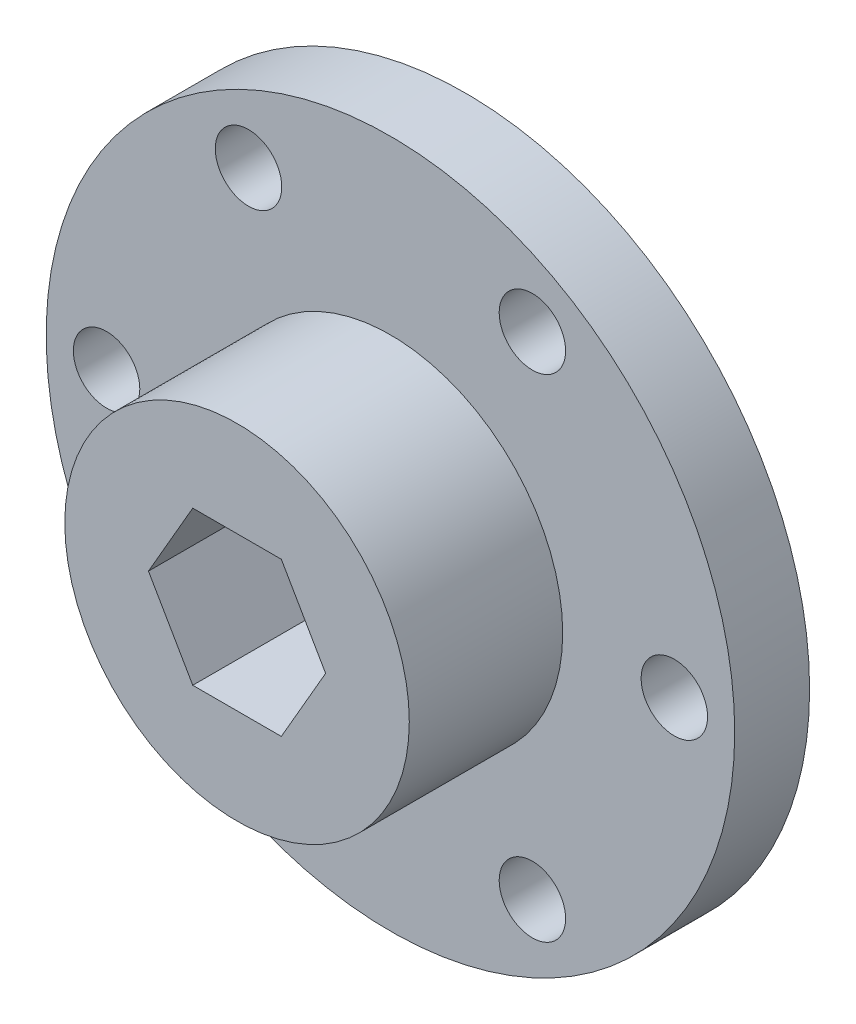
ISO-10303-21;
HEADER;
FILE_DESCRIPTION(('STEP AP214'),'2;1');
FILE_NAME('part.step','',(''),(''),'','','');
FILE_SCHEMA(('AUTOMOTIVE_DESIGN { 1 0 10303 214 1 1 1 1 }'));
ENDSEC;
DATA;
#1=APPLICATION_CONTEXT('core data for automotive mechanical design processes');
#2=APPLICATION_PROTOCOL_DEFINITION('international standard','automotive_design',2000,#1);
#3=PRODUCT_CONTEXT('',#1,'mechanical');
#4=PRODUCT('Part','Part','',(#3));
#5=PRODUCT_RELATED_PRODUCT_CATEGORY('part','',(#4));
#6=PRODUCT_DEFINITION_FORMATION('','',#4);
#7=PRODUCT_DEFINITION_CONTEXT('part definition',#1,'design');
#8=PRODUCT_DEFINITION('design','',#6,#7);
#9=PRODUCT_DEFINITION_SHAPE('','',#8);
#10=(LENGTH_UNIT() NAMED_UNIT(*) SI_UNIT(.MILLI.,.METRE.));
#11=(NAMED_UNIT(*) PLANE_ANGLE_UNIT() SI_UNIT($,.RADIAN.));
#12=(NAMED_UNIT(*) SI_UNIT($,.STERADIAN.) SOLID_ANGLE_UNIT());
#13=UNCERTAINTY_MEASURE_WITH_UNIT(LENGTH_MEASURE(1.E-05),#10,'distance_accuracy_value','');
#14=(GEOMETRIC_REPRESENTATION_CONTEXT(3) GLOBAL_UNCERTAINTY_ASSIGNED_CONTEXT((#13)) GLOBAL_UNIT_ASSIGNED_CONTEXT((#10,
#11,#12)) REPRESENTATION_CONTEXT('',''));
#15=CARTESIAN_POINT('',(0.,0.,0.));
#16=DIRECTION('',(0.,0.,1.));
#17=DIRECTION('',(1.,0.,0.));
#18=AXIS2_PLACEMENT_3D('',#15,#16,#17);
#19=CARTESIAN_POINT('',(0.,0.,6.2));
#20=DIRECTION('',(0.,0.,1.));
#21=DIRECTION('',(1.,0.,0.));
#22=AXIS2_PLACEMENT_3D('',#19,#20,#21);
#23=PLANE('',#22);
#24=CARTESIAN_POINT('',(23.5,0.,6.2));
#25=DIRECTION('',(0.,0.,1.));
#26=DIRECTION('',(1.,0.,0.));
#27=AXIS2_PLACEMENT_3D('',#24,#25,#26);
#28=CIRCLE('',#27,2.75);
#29=CARTESIAN_POINT('',(26.25,0.,6.2));
#30=VERTEX_POINT('',#29);
#31=EDGE_CURVE('E108',#30,#30,#28,.T.);
#32=ORIENTED_EDGE('',*,*,#31,.F.);
#33=EDGE_LOOP('',(#32));
#34=FACE_BOUND('',#33,.T.);
#35=CARTESIAN_POINT('',(11.75,-20.3515969889343,6.2));
#36=DIRECTION('',(0.,0.,1.));
#37=DIRECTION('',(1.,0.,0.));
#38=AXIS2_PLACEMENT_3D('',#35,#36,#37);
#39=CIRCLE('',#38,2.75);
#40=CARTESIAN_POINT('',(14.5,-20.3515969889343,6.2));
#41=VERTEX_POINT('',#40);
#42=EDGE_CURVE('E195',#41,#41,#39,.T.);
#43=ORIENTED_EDGE('',*,*,#42,.F.);
#44=EDGE_LOOP('',(#43));
#45=FACE_BOUND('',#44,.T.);
#46=CARTESIAN_POINT('',(-11.75,-20.3515969889343,6.2));
#47=DIRECTION('',(0.,0.,1.));
#48=DIRECTION('',(1.,0.,0.));
#49=AXIS2_PLACEMENT_3D('',#46,#47,#48);
#50=CIRCLE('',#49,2.75);
#51=CARTESIAN_POINT('',(-9.00000000000001,-20.3515969889343,6.2));
#52=VERTEX_POINT('',#51);
#53=EDGE_CURVE('E197',#52,#52,#50,.T.);
#54=ORIENTED_EDGE('',*,*,#53,.F.);
#55=EDGE_LOOP('',(#54));
#56=FACE_BOUND('',#55,.T.);
#57=CARTESIAN_POINT('',(-23.5,0.,6.2));
#58=DIRECTION('',(0.,0.,1.));
#59=DIRECTION('',(1.,0.,0.));
#60=AXIS2_PLACEMENT_3D('',#57,#58,#59);
#61=CIRCLE('',#60,2.75);
#62=CARTESIAN_POINT('',(-20.75,0.,6.2));
#63=VERTEX_POINT('',#62);
#64=EDGE_CURVE('E203',#63,#63,#61,.T.);
#65=ORIENTED_EDGE('',*,*,#64,.F.);
#66=EDGE_LOOP('',(#65));
#67=FACE_BOUND('',#66,.T.);
#68=CARTESIAN_POINT('',(-11.75,20.3515969889343,6.2));
#69=DIRECTION('',(0.,0.,1.));
#70=DIRECTION('',(1.,0.,0.));
#71=AXIS2_PLACEMENT_3D('',#68,#69,#70);
#72=CIRCLE('',#71,2.75);
#73=CARTESIAN_POINT('',(-9.00000000000001,20.3515969889343,6.2));
#74=VERTEX_POINT('',#73);
#75=EDGE_CURVE('E202',#74,#74,#72,.T.);
#76=ORIENTED_EDGE('',*,*,#75,.F.);
#77=EDGE_LOOP('',(#76));
#78=FACE_BOUND('',#77,.T.);
#79=CARTESIAN_POINT('',(11.75,20.3515969889343,6.2));
#80=DIRECTION('',(0.,0.,1.));
#81=DIRECTION('',(1.,0.,0.));
#82=AXIS2_PLACEMENT_3D('',#79,#80,#81);
#83=CIRCLE('',#82,2.75);
#84=CARTESIAN_POINT('',(14.5,20.3515969889343,6.2));
#85=VERTEX_POINT('',#84);
#86=EDGE_CURVE('E207',#85,#85,#83,.T.);
#87=ORIENTED_EDGE('',*,*,#86,.F.);
#88=EDGE_LOOP('',(#87));
#89=FACE_BOUND('',#88,.T.);
#90=CARTESIAN_POINT('',(0.,0.,6.2));
#91=DIRECTION('',(0.,0.,1.));
#92=DIRECTION('',(1.,0.,0.));
#93=AXIS2_PLACEMENT_3D('',#90,#91,#92);
#94=CIRCLE('',#93,14.26);
#95=CARTESIAN_POINT('',(14.26,0.,6.2));
#96=VERTEX_POINT('',#95);
#97=EDGE_CURVE('E11',#96,#96,#94,.T.);
#98=ORIENTED_EDGE('',*,*,#97,.F.);
#99=EDGE_LOOP('',(#98));
#100=FACE_BOUND('',#99,.T.);
#101=CARTESIAN_POINT('',(0.,0.,6.2));
#102=DIRECTION('',(0.,0.,1.));
#103=DIRECTION('',(1.,0.,0.));
#104=AXIS2_PLACEMENT_3D('',#101,#102,#103);
#105=CIRCLE('',#104,28.5);
#106=CARTESIAN_POINT('',(28.5,0.,6.2));
#107=VERTEX_POINT('',#106);
#108=EDGE_CURVE('E48',#107,#107,#105,.T.);
#109=ORIENTED_EDGE('',*,*,#108,.T.);
#110=EDGE_LOOP('',(#109));
#111=FACE_BOUND('',#110,.T.);
#112=ADVANCED_FACE('F39',(#34,#45,#56,#67,#78,#89,#100,#111),#23,.T.);
#113=CARTESIAN_POINT('',(0.,0.,0.));
#114=DIRECTION('',(0.,0.,1.));
#115=DIRECTION('',(1.,0.,0.));
#116=AXIS2_PLACEMENT_3D('',#113,#114,#115);
#117=PLANE('',#116);
#118=CARTESIAN_POINT('',(23.5,0.,0.));
#119=DIRECTION('',(0.,0.,-1.));
#120=DIRECTION('',(-1.,0.,0.));
#121=AXIS2_PLACEMENT_3D('',#118,#119,#120);
#122=CIRCLE('',#121,2.75);
#123=CARTESIAN_POINT('',(20.75,0.,0.));
#124=VERTEX_POINT('',#123);
#125=EDGE_CURVE('E318',#124,#124,#122,.T.);
#126=ORIENTED_EDGE('',*,*,#125,.F.);
#127=EDGE_LOOP('',(#126));
#128=FACE_BOUND('',#127,.T.);
#129=CARTESIAN_POINT('',(11.75,-20.3515969889343,0.));
#130=DIRECTION('',(0.,0.,-1.));
#131=DIRECTION('',(-1.,0.,0.));
#132=AXIS2_PLACEMENT_3D('',#129,#130,#131);
#133=CIRCLE('',#132,2.75);
#134=CARTESIAN_POINT('',(9.,-20.3515969889343,0.));
#135=VERTEX_POINT('',#134);
#136=EDGE_CURVE('E317',#135,#135,#133,.T.);
#137=ORIENTED_EDGE('',*,*,#136,.F.);
#138=EDGE_LOOP('',(#137));
#139=FACE_BOUND('',#138,.T.);
#140=CARTESIAN_POINT('',(-11.75,-20.3515969889343,0.));
#141=DIRECTION('',(0.,0.,-1.));
#142=DIRECTION('',(-1.,0.,0.));
#143=AXIS2_PLACEMENT_3D('',#140,#141,#142);
#144=CIRCLE('',#143,2.75);
#145=CARTESIAN_POINT('',(-14.5,-20.3515969889343,0.));
#146=VERTEX_POINT('',#145);
#147=EDGE_CURVE('E325',#146,#146,#144,.T.);
#148=ORIENTED_EDGE('',*,*,#147,.F.);
#149=EDGE_LOOP('',(#148));
#150=FACE_BOUND('',#149,.T.);
#151=CARTESIAN_POINT('',(-23.5,0.,0.));
#152=DIRECTION('',(0.,0.,-1.));
#153=DIRECTION('',(-1.,0.,0.));
#154=AXIS2_PLACEMENT_3D('',#151,#152,#153);
#155=CIRCLE('',#154,2.75);
#156=CARTESIAN_POINT('',(-26.25,0.,0.));
#157=VERTEX_POINT('',#156);
#158=EDGE_CURVE('E343',#157,#157,#155,.T.);
#159=ORIENTED_EDGE('',*,*,#158,.F.);
#160=EDGE_LOOP('',(#159));
#161=FACE_BOUND('',#160,.T.);
#162=CARTESIAN_POINT('',(-11.75,20.3515969889343,0.));
#163=DIRECTION('',(0.,0.,-1.));
#164=DIRECTION('',(-1.,0.,0.));
#165=AXIS2_PLACEMENT_3D('',#162,#163,#164);
#166=CIRCLE('',#165,2.75);
#167=CARTESIAN_POINT('',(-14.5,20.3515969889343,0.));
#168=VERTEX_POINT('',#167);
#169=EDGE_CURVE('E328',#168,#168,#166,.T.);
#170=ORIENTED_EDGE('',*,*,#169,.F.);
#171=EDGE_LOOP('',(#170));
#172=FACE_BOUND('',#171,.T.);
#173=CARTESIAN_POINT('',(11.75,20.3515969889343,0.));
#174=DIRECTION('',(0.,0.,-1.));
#175=DIRECTION('',(-1.,0.,0.));
#176=AXIS2_PLACEMENT_3D('',#173,#174,#175);
#177=CIRCLE('',#176,2.75);
#178=CARTESIAN_POINT('',(9.,20.3515969889343,0.));
#179=VERTEX_POINT('',#178);
#180=EDGE_CURVE('E326',#179,#179,#177,.T.);
#181=ORIENTED_EDGE('',*,*,#180,.F.);
#182=EDGE_LOOP('',(#181));
#183=FACE_BOUND('',#182,.T.);
#184=CARTESIAN_POINT('',(0.,0.,0.));
#185=DIRECTION('',(0.,0.,1.));
#186=DIRECTION('',(1.,0.,0.));
#187=AXIS2_PLACEMENT_3D('',#184,#185,#186);
#188=CIRCLE('',#187,28.5);
#189=CARTESIAN_POINT('',(28.5,0.,0.));
#190=VERTEX_POINT('',#189);
#191=EDGE_CURVE('E43',#190,#190,#188,.T.);
#192=ORIENTED_EDGE('',*,*,#191,.F.);
#193=EDGE_LOOP('',(#192));
#194=FACE_BOUND('',#193,.T.);
#195=DIRECTION('',(0.5,0.866025403784439,0.));
#196=VECTOR('',#195,1.);
#197=CARTESIAN_POINT('',(3.66617420935412,-6.35,0.));
#198=LINE('',#197,#196);
#199=CARTESIAN_POINT('',(3.66617420935412,-6.35,0.));
#200=VERTEX_POINT('',#199);
#201=CARTESIAN_POINT('',(7.33234841870824,0.,0.));
#202=VERTEX_POINT('',#201);
#203=EDGE_CURVE('E57',#200,#202,#198,.T.);
#204=ORIENTED_EDGE('',*,*,#203,.T.);
#205=DIRECTION('',(-0.5,0.866025403784439,0.));
#206=VECTOR('',#205,1.);
#207=CARTESIAN_POINT('',(7.33234841870824,0.,0.));
#208=LINE('',#207,#206);
#209=CARTESIAN_POINT('',(3.66617420935412,6.35,0.));
#210=VERTEX_POINT('',#209);
#211=EDGE_CURVE('E132',#202,#210,#208,.T.);
#212=ORIENTED_EDGE('',*,*,#211,.T.);
#213=DIRECTION('',(-1.,0.,0.));
#214=VECTOR('',#213,1.);
#215=CARTESIAN_POINT('',(3.66617420935412,6.35,0.));
#216=LINE('',#215,#214);
#217=CARTESIAN_POINT('',(-3.66617420935412,6.35,0.));
#218=VERTEX_POINT('',#217);
#219=EDGE_CURVE('E131',#210,#218,#216,.T.);
#220=ORIENTED_EDGE('',*,*,#219,.T.);
#221=DIRECTION('',(-0.5,-0.866025403784438,0.));
#222=VECTOR('',#221,1.);
#223=CARTESIAN_POINT('',(-3.66617420935412,6.35,0.));
#224=LINE('',#223,#222);
#225=CARTESIAN_POINT('',(-7.33234841870825,0.,0.));
#226=VERTEX_POINT('',#225);
#227=EDGE_CURVE('E136',#218,#226,#224,.T.);
#228=ORIENTED_EDGE('',*,*,#227,.T.);
#229=DIRECTION('',(0.5,-0.866025403784439,0.));
#230=VECTOR('',#229,1.);
#231=CARTESIAN_POINT('',(-7.33234841870825,0.,0.));
#232=LINE('',#231,#230);
#233=CARTESIAN_POINT('',(-3.66617420935413,-6.35,0.));
#234=VERTEX_POINT('',#233);
#235=EDGE_CURVE('E137',#226,#234,#232,.T.);
#236=ORIENTED_EDGE('',*,*,#235,.T.);
#237=DIRECTION('',(1.,0.,0.));
#238=VECTOR('',#237,1.);
#239=CARTESIAN_POINT('',(-3.66617420935413,-6.35,0.));
#240=LINE('',#239,#238);
#241=EDGE_CURVE('E105',#234,#200,#240,.T.);
#242=ORIENTED_EDGE('',*,*,#241,.T.);
#243=EDGE_LOOP('',(#204,#212,#220,#228,#236,#242));
#244=FACE_BOUND('',#243,.T.);
#245=ADVANCED_FACE('F157',(#128,#139,#150,#161,#172,#183,#194,#244),#117,.F.);
#246=CARTESIAN_POINT('',(0.,0.,6.2));
#247=DIRECTION('',(0.,0.,-1.));
#248=DIRECTION('',(-1.,0.,0.));
#249=AXIS2_PLACEMENT_3D('',#246,#247,#248);
#250=CYLINDRICAL_SURFACE('',#249,28.5);
#251=ORIENTED_EDGE('',*,*,#108,.F.);
#252=EDGE_LOOP('',(#251));
#253=FACE_BOUND('',#252,.T.);
#254=ORIENTED_EDGE('',*,*,#191,.T.);
#255=EDGE_LOOP('',(#254));
#256=FACE_BOUND('',#255,.T.);
#257=ADVANCED_FACE('F41',(#253,#256),#250,.T.);
#258=CARTESIAN_POINT('',(3.66617420935412,-6.35,6.2));
#259=DIRECTION('',(-0.866025403784439,0.5,0.));
#260=DIRECTION('',(-0.5,-0.866025403784439,0.));
#261=AXIS2_PLACEMENT_3D('',#258,#259,#260);
#262=PLANE('',#261);
#263=ORIENTED_EDGE('',*,*,#203,.F.);
#264=DIRECTION('',(0.,0.,-1.));
#265=VECTOR('',#264,1.);
#266=CARTESIAN_POINT('',(3.66617420935412,-6.35,6.2));
#267=LINE('',#266,#265);
#268=CARTESIAN_POINT('',(3.66617420935412,-6.35,18.9));
#269=VERTEX_POINT('',#268);
#270=EDGE_CURVE('E94',#269,#200,#267,.T.);
#271=ORIENTED_EDGE('',*,*,#270,.F.);
#272=DIRECTION('',(0.5,0.866025403784439,0.));
#273=VECTOR('',#272,1.);
#274=CARTESIAN_POINT('',(3.66617420935412,-6.35,18.9));
#275=LINE('',#274,#273);
#276=CARTESIAN_POINT('',(7.33234841870824,0.,18.9));
#277=VERTEX_POINT('',#276);
#278=EDGE_CURVE('E98',#269,#277,#275,.T.);
#279=ORIENTED_EDGE('',*,*,#278,.T.);
#280=DIRECTION('',(0.,0.,-1.));
#281=VECTOR('',#280,1.);
#282=CARTESIAN_POINT('',(7.33234841870824,0.,6.2));
#283=LINE('',#282,#281);
#284=EDGE_CURVE('E151',#277,#202,#283,.T.);
#285=ORIENTED_EDGE('',*,*,#284,.T.);
#286=EDGE_LOOP('',(#263,#271,#279,#285));
#287=FACE_BOUND('',#286,.T.);
#288=ADVANCED_FACE('F96',(#287),#262,.T.);
#289=CARTESIAN_POINT('',(7.33234841870824,0.,6.2));
#290=DIRECTION('',(-0.866025403784439,-0.5,0.));
#291=DIRECTION('',(0.5,-0.866025403784439,0.));
#292=AXIS2_PLACEMENT_3D('',#289,#290,#291);
#293=PLANE('',#292);
#294=ORIENTED_EDGE('',*,*,#211,.F.);
#295=ORIENTED_EDGE('',*,*,#284,.F.);
#296=DIRECTION('',(-0.5,0.866025403784439,0.));
#297=VECTOR('',#296,1.);
#298=CARTESIAN_POINT('',(7.33234841870824,0.,18.9));
#299=LINE('',#298,#297);
#300=CARTESIAN_POINT('',(3.66617420935412,6.35,18.9));
#301=VERTEX_POINT('',#300);
#302=EDGE_CURVE('E111',#277,#301,#299,.T.);
#303=ORIENTED_EDGE('',*,*,#302,.T.);
#304=DIRECTION('',(0.,0.,-1.));
#305=VECTOR('',#304,1.);
#306=CARTESIAN_POINT('',(3.66617420935412,6.35,6.2));
#307=LINE('',#306,#305);
#308=EDGE_CURVE('E149',#301,#210,#307,.T.);
#309=ORIENTED_EDGE('',*,*,#308,.T.);
#310=EDGE_LOOP('',(#294,#295,#303,#309));
#311=FACE_BOUND('',#310,.T.);
#312=ADVANCED_FACE('F175',(#311),#293,.T.);
#313=CARTESIAN_POINT('',(3.66617420935412,6.35,6.2));
#314=DIRECTION('',(0.,-1.,0.));
#315=DIRECTION('',(1.,0.,0.));
#316=AXIS2_PLACEMENT_3D('',#313,#314,#315);
#317=PLANE('',#316);
#318=ORIENTED_EDGE('',*,*,#219,.F.);
#319=ORIENTED_EDGE('',*,*,#308,.F.);
#320=DIRECTION('',(-1.,0.,0.));
#321=VECTOR('',#320,1.);
#322=CARTESIAN_POINT('',(3.66617420935412,6.35,18.9));
#323=LINE('',#322,#321);
#324=CARTESIAN_POINT('',(-3.66617420935412,6.35,18.9));
#325=VERTEX_POINT('',#324);
#326=EDGE_CURVE('E117',#301,#325,#323,.T.);
#327=ORIENTED_EDGE('',*,*,#326,.T.);
#328=DIRECTION('',(0.,0.,-1.));
#329=VECTOR('',#328,1.);
#330=CARTESIAN_POINT('',(-3.66617420935412,6.35,6.2));
#331=LINE('',#330,#329);
#332=EDGE_CURVE('E150',#325,#218,#331,.T.);
#333=ORIENTED_EDGE('',*,*,#332,.T.);
#334=EDGE_LOOP('',(#318,#319,#327,#333));
#335=FACE_BOUND('',#334,.T.);
#336=ADVANCED_FACE('F168',(#335),#317,.T.);
#337=CARTESIAN_POINT('',(-3.66617420935412,6.35,6.2));
#338=DIRECTION('',(0.866025403784438,-0.5,0.));
#339=DIRECTION('',(0.5,0.866025403784439,0.));
#340=AXIS2_PLACEMENT_3D('',#337,#338,#339);
#341=PLANE('',#340);
#342=ORIENTED_EDGE('',*,*,#227,.F.);
#343=ORIENTED_EDGE('',*,*,#332,.F.);
#344=DIRECTION('',(-0.5,-0.866025403784438,0.));
#345=VECTOR('',#344,1.);
#346=CARTESIAN_POINT('',(-3.66617420935412,6.35,18.9));
#347=LINE('',#346,#345);
#348=CARTESIAN_POINT('',(-7.33234841870825,0.,18.9));
#349=VERTEX_POINT('',#348);
#350=EDGE_CURVE('E121',#325,#349,#347,.T.);
#351=ORIENTED_EDGE('',*,*,#350,.T.);
#352=DIRECTION('',(0.,0.,-1.));
#353=VECTOR('',#352,1.);
#354=CARTESIAN_POINT('',(-7.33234841870825,0.,6.2));
#355=LINE('',#354,#353);
#356=EDGE_CURVE('E144',#349,#226,#355,.T.);
#357=ORIENTED_EDGE('',*,*,#356,.T.);
#358=EDGE_LOOP('',(#342,#343,#351,#357));
#359=FACE_BOUND('',#358,.T.);
#360=ADVANCED_FACE('F170',(#359),#341,.T.);
#361=CARTESIAN_POINT('',(-7.33234841870825,0.,6.2));
#362=DIRECTION('',(0.866025403784439,0.5,0.));
#363=DIRECTION('',(-0.5,0.866025403784439,0.));
#364=AXIS2_PLACEMENT_3D('',#361,#362,#363);
#365=PLANE('',#364);
#366=ORIENTED_EDGE('',*,*,#235,.F.);
#367=ORIENTED_EDGE('',*,*,#356,.F.);
#368=DIRECTION('',(0.5,-0.866025403784439,0.));
#369=VECTOR('',#368,1.);
#370=CARTESIAN_POINT('',(-7.33234841870825,0.,18.9));
#371=LINE('',#370,#369);
#372=CARTESIAN_POINT('',(-3.66617420935413,-6.35,18.9));
#373=VERTEX_POINT('',#372);
#374=EDGE_CURVE('E122',#349,#373,#371,.T.);
#375=ORIENTED_EDGE('',*,*,#374,.T.);
#376=DIRECTION('',(0.,0.,-1.));
#377=VECTOR('',#376,1.);
#378=CARTESIAN_POINT('',(-3.66617420935413,-6.35,6.2));
#379=LINE('',#378,#377);
#380=EDGE_CURVE('E61',#373,#234,#379,.T.);
#381=ORIENTED_EDGE('',*,*,#380,.T.);
#382=EDGE_LOOP('',(#366,#367,#375,#381));
#383=FACE_BOUND('',#382,.T.);
#384=ADVANCED_FACE('F163',(#383),#365,.T.);
#385=CARTESIAN_POINT('',(-3.66617420935413,-6.35,6.2));
#386=DIRECTION('',(0.,1.,0.));
#387=DIRECTION('',(-1.,0.,0.));
#388=AXIS2_PLACEMENT_3D('',#385,#386,#387);
#389=PLANE('',#388);
#390=ORIENTED_EDGE('',*,*,#241,.F.);
#391=ORIENTED_EDGE('',*,*,#380,.F.);
#392=DIRECTION('',(1.,0.,0.));
#393=VECTOR('',#392,1.);
#394=CARTESIAN_POINT('',(-3.66617420935413,-6.35,18.9));
#395=LINE('',#394,#393);
#396=EDGE_CURVE('E104',#373,#269,#395,.T.);
#397=ORIENTED_EDGE('',*,*,#396,.T.);
#398=ORIENTED_EDGE('',*,*,#270,.T.);
#399=EDGE_LOOP('',(#390,#391,#397,#398));
#400=FACE_BOUND('',#399,.T.);
#401=ADVANCED_FACE('F106',(#400),#389,.T.);
#402=CARTESIAN_POINT('',(0.,0.,18.9));
#403=DIRECTION('',(0.,0.,1.));
#404=DIRECTION('',(1.,0.,0.));
#405=AXIS2_PLACEMENT_3D('',#402,#403,#404);
#406=PLANE('',#405);
#407=CARTESIAN_POINT('',(0.,0.,18.9));
#408=DIRECTION('',(0.,0.,1.));
#409=DIRECTION('',(1.,0.,0.));
#410=AXIS2_PLACEMENT_3D('',#407,#408,#409);
#411=CIRCLE('',#410,14.26);
#412=CARTESIAN_POINT('',(14.26,0.,18.9));
#413=VERTEX_POINT('',#412);
#414=EDGE_CURVE('E130',#413,#413,#411,.T.);
#415=ORIENTED_EDGE('',*,*,#414,.T.);
#416=EDGE_LOOP('',(#415));
#417=FACE_BOUND('',#416,.T.);
#418=ORIENTED_EDGE('',*,*,#278,.F.);
#419=ORIENTED_EDGE('',*,*,#396,.F.);
#420=ORIENTED_EDGE('',*,*,#374,.F.);
#421=ORIENTED_EDGE('',*,*,#350,.F.);
#422=ORIENTED_EDGE('',*,*,#326,.F.);
#423=ORIENTED_EDGE('',*,*,#302,.F.);
#424=EDGE_LOOP('',(#418,#419,#420,#421,#422,#423));
#425=FACE_BOUND('',#424,.T.);
#426=ADVANCED_FACE('F112',(#417,#425),#406,.T.);
#427=CARTESIAN_POINT('',(0.,0.,18.9));
#428=DIRECTION('',(0.,0.,-1.));
#429=DIRECTION('',(-1.,0.,0.));
#430=AXIS2_PLACEMENT_3D('',#427,#428,#429);
#431=CYLINDRICAL_SURFACE('',#430,14.26);
#432=ORIENTED_EDGE('',*,*,#414,.F.);
#433=EDGE_LOOP('',(#432));
#434=FACE_BOUND('',#433,.T.);
#435=ORIENTED_EDGE('',*,*,#97,.T.);
#436=EDGE_LOOP('',(#435));
#437=FACE_BOUND('',#436,.T.);
#438=ADVANCED_FACE('F215',(#434,#437),#431,.T.);
#439=CARTESIAN_POINT('',(11.75,20.3515969889343,18.9));
#440=DIRECTION('',(0.,0.,-1.));
#441=DIRECTION('',(-1.,0.,0.));
#442=AXIS2_PLACEMENT_3D('',#439,#440,#441);
#443=CYLINDRICAL_SURFACE('',#442,2.75);
#444=ORIENTED_EDGE('',*,*,#86,.T.);
#445=EDGE_LOOP('',(#444));
#446=FACE_BOUND('',#445,.T.);
#447=ORIENTED_EDGE('',*,*,#180,.T.);
#448=EDGE_LOOP('',(#447));
#449=FACE_BOUND('',#448,.T.);
#450=ADVANCED_FACE('F213',(#446,#449),#443,.F.);
#451=CARTESIAN_POINT('',(-11.75,20.3515969889343,18.9));
#452=DIRECTION('',(0.,0.,-1.));
#453=DIRECTION('',(-1.,0.,0.));
#454=AXIS2_PLACEMENT_3D('',#451,#452,#453);
#455=CYLINDRICAL_SURFACE('',#454,2.75);
#456=ORIENTED_EDGE('',*,*,#75,.T.);
#457=EDGE_LOOP('',(#456));
#458=FACE_BOUND('',#457,.T.);
#459=ORIENTED_EDGE('',*,*,#169,.T.);
#460=EDGE_LOOP('',(#459));
#461=FACE_BOUND('',#460,.T.);
#462=ADVANCED_FACE('F219',(#458,#461),#455,.F.);
#463=CARTESIAN_POINT('',(-23.5,0.,18.9));
#464=DIRECTION('',(0.,0.,-1.));
#465=DIRECTION('',(-1.,0.,0.));
#466=AXIS2_PLACEMENT_3D('',#463,#464,#465);
#467=CYLINDRICAL_SURFACE('',#466,2.75);
#468=ORIENTED_EDGE('',*,*,#64,.T.);
#469=EDGE_LOOP('',(#468));
#470=FACE_BOUND('',#469,.T.);
#471=ORIENTED_EDGE('',*,*,#158,.T.);
#472=EDGE_LOOP('',(#471));
#473=FACE_BOUND('',#472,.T.);
#474=ADVANCED_FACE('F275',(#470,#473),#467,.F.);
#475=CARTESIAN_POINT('',(-11.75,-20.3515969889343,18.9));
#476=DIRECTION('',(0.,0.,-1.));
#477=DIRECTION('',(-1.,0.,0.));
#478=AXIS2_PLACEMENT_3D('',#475,#476,#477);
#479=CYLINDRICAL_SURFACE('',#478,2.75);
#480=ORIENTED_EDGE('',*,*,#53,.T.);
#481=EDGE_LOOP('',(#480));
#482=FACE_BOUND('',#481,.T.);
#483=ORIENTED_EDGE('',*,*,#147,.T.);
#484=EDGE_LOOP('',(#483));
#485=FACE_BOUND('',#484,.T.);
#486=ADVANCED_FACE('F285',(#482,#485),#479,.F.);
#487=CARTESIAN_POINT('',(11.75,-20.3515969889343,18.9));
#488=DIRECTION('',(0.,0.,-1.));
#489=DIRECTION('',(-1.,0.,0.));
#490=AXIS2_PLACEMENT_3D('',#487,#488,#489);
#491=CYLINDRICAL_SURFACE('',#490,2.75);
#492=ORIENTED_EDGE('',*,*,#42,.T.);
#493=EDGE_LOOP('',(#492));
#494=FACE_BOUND('',#493,.T.);
#495=ORIENTED_EDGE('',*,*,#136,.T.);
#496=EDGE_LOOP('',(#495));
#497=FACE_BOUND('',#496,.T.);
#498=ADVANCED_FACE('F295',(#494,#497),#491,.F.);
#499=CARTESIAN_POINT('',(23.5,0.,18.9));
#500=DIRECTION('',(0.,0.,-1.));
#501=DIRECTION('',(-1.,0.,0.));
#502=AXIS2_PLACEMENT_3D('',#499,#500,#501);
#503=CYLINDRICAL_SURFACE('',#502,2.75);
#504=ORIENTED_EDGE('',*,*,#31,.T.);
#505=EDGE_LOOP('',(#504));
#506=FACE_BOUND('',#505,.T.);
#507=ORIENTED_EDGE('',*,*,#125,.T.);
#508=EDGE_LOOP('',(#507));
#509=FACE_BOUND('',#508,.T.);
#510=ADVANCED_FACE('F301',(#506,#509),#503,.F.);
#511=CLOSED_SHELL('',(#112,#245,#257,#288,#312,#336,#360,#384,#401,#426,#438,#450,#462,#474,
#486,#498,#510));
#512=MANIFOLD_SOLID_BREP('B2',#511);
#513=ADVANCED_BREP_SHAPE_REPRESENTATION('',(#18,#512),#14);
#514=SHAPE_DEFINITION_REPRESENTATION(#9,#513);
ENDSEC;
END-ISO-10303-21;
